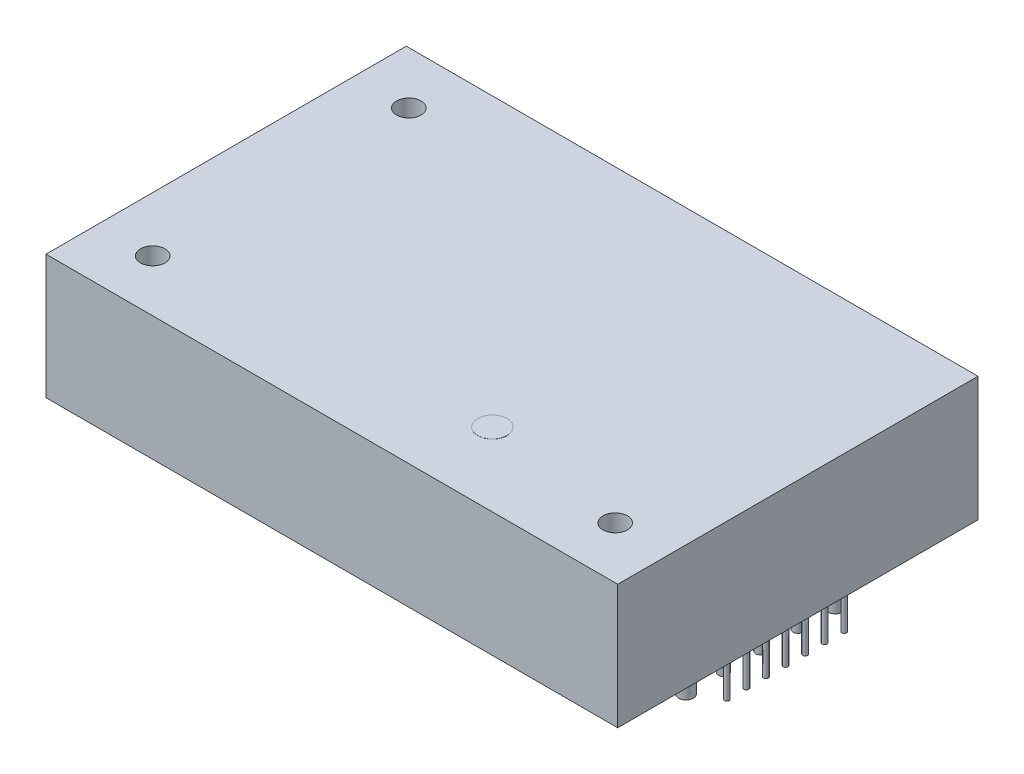
ISO-10303-21;
HEADER;
FILE_DESCRIPTION(('STEP AP214'),'2;1');
FILE_NAME('part.step','',(''),(''),'','','');
FILE_SCHEMA(('AUTOMOTIVE_DESIGN { 1 0 10303 214 1 1 1 1 }'));
ENDSEC;
DATA;
#1=APPLICATION_CONTEXT('core data for automotive mechanical design processes');
#2=APPLICATION_PROTOCOL_DEFINITION('international standard','automotive_design',2000,#1);
#3=PRODUCT_CONTEXT('',#1,'mechanical');
#4=PRODUCT('Part','Part','',(#3));
#5=PRODUCT_RELATED_PRODUCT_CATEGORY('part','',(#4));
#6=PRODUCT_DEFINITION_FORMATION('','',#4);
#7=PRODUCT_DEFINITION_CONTEXT('part definition',#1,'design');
#8=PRODUCT_DEFINITION('design','',#6,#7);
#9=PRODUCT_DEFINITION_SHAPE('','',#8);
#10=(LENGTH_UNIT() NAMED_UNIT(*) SI_UNIT(.MILLI.,.METRE.));
#11=(NAMED_UNIT(*) PLANE_ANGLE_UNIT() SI_UNIT($,.RADIAN.));
#12=(NAMED_UNIT(*) SI_UNIT($,.STERADIAN.) SOLID_ANGLE_UNIT());
#13=UNCERTAINTY_MEASURE_WITH_UNIT(LENGTH_MEASURE(1.E-05),#10,'distance_accuracy_value','');
#14=(GEOMETRIC_REPRESENTATION_CONTEXT(3) GLOBAL_UNCERTAINTY_ASSIGNED_CONTEXT((#13)) GLOBAL_UNIT_ASSIGNED_CONTEXT((#10,
#11,#12)) REPRESENTATION_CONTEXT('',''));
#15=CARTESIAN_POINT('',(0.,0.,0.));
#16=DIRECTION('',(0.,0.,1.));
#17=DIRECTION('',(1.,0.,0.));
#18=AXIS2_PLACEMENT_3D('',#15,#16,#17);
#19=CARTESIAN_POINT('',(-29.2,12.7,-18.4));
#20=DIRECTION('',(1.,0.,0.));
#21=DIRECTION('',(0.,0.,-1.));
#22=AXIS2_PLACEMENT_3D('',#19,#20,#21);
#23=PLANE('',#22);
#24=DIRECTION('',(0.,0.,1.));
#25=VECTOR('',#24,1.);
#26=CARTESIAN_POINT('',(-29.2,0.,-18.4));
#27=LINE('',#26,#25);
#28=CARTESIAN_POINT('',(-29.2,0.,-18.4));
#29=VERTEX_POINT('',#28);
#30=CARTESIAN_POINT('',(-29.2,0.,18.4));
#31=VERTEX_POINT('',#30);
#32=EDGE_CURVE('E219',#29,#31,#27,.T.);
#33=ORIENTED_EDGE('',*,*,#32,.T.);
#34=DIRECTION('',(0.,-1.,0.));
#35=VECTOR('',#34,1.);
#36=CARTESIAN_POINT('',(-29.2,12.7,18.4));
#37=LINE('',#36,#35);
#38=CARTESIAN_POINT('',(-29.2,12.7,18.4));
#39=VERTEX_POINT('',#38);
#40=EDGE_CURVE('E46',#39,#31,#37,.T.);
#41=ORIENTED_EDGE('',*,*,#40,.F.);
#42=DIRECTION('',(0.,0.,1.));
#43=VECTOR('',#42,1.);
#44=CARTESIAN_POINT('',(-29.2,12.7,-18.4));
#45=LINE('',#44,#43);
#46=CARTESIAN_POINT('',(-29.2,12.7,-18.4));
#47=VERTEX_POINT('',#46);
#48=EDGE_CURVE('E222',#47,#39,#45,.T.);
#49=ORIENTED_EDGE('',*,*,#48,.F.);
#50=DIRECTION('',(0.,-1.,0.));
#51=VECTOR('',#50,1.);
#52=CARTESIAN_POINT('',(-29.2,12.7,-18.4));
#53=LINE('',#52,#51);
#54=EDGE_CURVE('E228',#47,#29,#53,.T.);
#55=ORIENTED_EDGE('',*,*,#54,.T.);
#56=EDGE_LOOP('',(#33,#41,#49,#55));
#57=FACE_BOUND('',#56,.T.);
#58=ADVANCED_FACE('F38',(#57),#23,.F.);
#59=CARTESIAN_POINT('',(29.2,12.7,18.4));
#60=DIRECTION('',(0.,0.,-1.));
#61=DIRECTION('',(-1.,0.,0.));
#62=AXIS2_PLACEMENT_3D('',#59,#60,#61);
#63=PLANE('',#62);
#64=DIRECTION('',(1.,0.,0.));
#65=VECTOR('',#64,1.);
#66=CARTESIAN_POINT('',(29.2,0.,18.4));
#67=LINE('',#66,#65);
#68=CARTESIAN_POINT('',(29.2,0.,18.4));
#69=VERTEX_POINT('',#68);
#70=EDGE_CURVE('E231',#31,#69,#67,.T.);
#71=ORIENTED_EDGE('',*,*,#70,.T.);
#72=DIRECTION('',(0.,-1.,0.));
#73=VECTOR('',#72,1.);
#74=CARTESIAN_POINT('',(29.2,12.7,18.4));
#75=LINE('',#74,#73);
#76=CARTESIAN_POINT('',(29.2,12.7,18.4));
#77=VERTEX_POINT('',#76);
#78=EDGE_CURVE('E238',#77,#69,#75,.T.);
#79=ORIENTED_EDGE('',*,*,#78,.F.);
#80=DIRECTION('',(1.,0.,0.));
#81=VECTOR('',#80,1.);
#82=CARTESIAN_POINT('',(29.2,12.7,18.4));
#83=LINE('',#82,#81);
#84=EDGE_CURVE('E86',#39,#77,#83,.T.);
#85=ORIENTED_EDGE('',*,*,#84,.F.);
#86=ORIENTED_EDGE('',*,*,#40,.T.);
#87=EDGE_LOOP('',(#71,#79,#85,#86));
#88=FACE_BOUND('',#87,.T.);
#89=ADVANCED_FACE('F240',(#88),#63,.F.);
#90=CARTESIAN_POINT('',(29.2,12.7,-18.4));
#91=DIRECTION('',(-1.,0.,0.));
#92=DIRECTION('',(0.,0.,1.));
#93=AXIS2_PLACEMENT_3D('',#90,#91,#92);
#94=PLANE('',#93);
#95=DIRECTION('',(0.,0.,-1.));
#96=VECTOR('',#95,1.);
#97=CARTESIAN_POINT('',(29.2,0.,-18.4));
#98=LINE('',#97,#96);
#99=CARTESIAN_POINT('',(29.2,0.,-18.4));
#100=VERTEX_POINT('',#99);
#101=EDGE_CURVE('E72',#69,#100,#98,.T.);
#102=ORIENTED_EDGE('',*,*,#101,.T.);
#103=DIRECTION('',(0.,-1.,0.));
#104=VECTOR('',#103,1.);
#105=CARTESIAN_POINT('',(29.2,12.7,-18.4));
#106=LINE('',#105,#104);
#107=CARTESIAN_POINT('',(29.2,12.7,-18.4));
#108=VERTEX_POINT('',#107);
#109=EDGE_CURVE('E236',#108,#100,#106,.T.);
#110=ORIENTED_EDGE('',*,*,#109,.F.);
#111=DIRECTION('',(0.,0.,-1.));
#112=VECTOR('',#111,1.);
#113=CARTESIAN_POINT('',(29.2,12.7,-18.4));
#114=LINE('',#113,#112);
#115=EDGE_CURVE('E225',#77,#108,#114,.T.);
#116=ORIENTED_EDGE('',*,*,#115,.F.);
#117=ORIENTED_EDGE('',*,*,#78,.T.);
#118=EDGE_LOOP('',(#102,#110,#116,#117));
#119=FACE_BOUND('',#118,.T.);
#120=ADVANCED_FACE('F268',(#119),#94,.F.);
#121=CARTESIAN_POINT('',(29.2,12.7,-18.4));
#122=DIRECTION('',(0.,0.,1.));
#123=DIRECTION('',(1.,0.,0.));
#124=AXIS2_PLACEMENT_3D('',#121,#122,#123);
#125=PLANE('',#124);
#126=DIRECTION('',(-1.,0.,0.));
#127=VECTOR('',#126,1.);
#128=CARTESIAN_POINT('',(29.2,0.,-18.4));
#129=LINE('',#128,#127);
#130=EDGE_CURVE('E78',#100,#29,#129,.T.);
#131=ORIENTED_EDGE('',*,*,#130,.T.);
#132=ORIENTED_EDGE('',*,*,#54,.F.);
#133=DIRECTION('',(-1.,0.,0.));
#134=VECTOR('',#133,1.);
#135=CARTESIAN_POINT('',(29.2,12.7,-18.4));
#136=LINE('',#135,#134);
#137=EDGE_CURVE('E54',#108,#47,#136,.T.);
#138=ORIENTED_EDGE('',*,*,#137,.F.);
#139=ORIENTED_EDGE('',*,*,#109,.T.);
#140=EDGE_LOOP('',(#131,#132,#138,#139));
#141=FACE_BOUND('',#140,.T.);
#142=ADVANCED_FACE('F258',(#141),#125,.F.);
#143=CARTESIAN_POINT('',(0.,12.7,0.));
#144=DIRECTION('',(0.,-1.,0.));
#145=DIRECTION('',(0.,0.,-1.));
#146=AXIS2_PLACEMENT_3D('',#143,#144,#145);
#147=PLANE('',#146);
#148=CARTESIAN_POINT('',(8.9,12.7,10.9));
#149=DIRECTION('',(0.,-1.,0.));
#150=DIRECTION('',(0.,0.,-1.));
#151=AXIS2_PLACEMENT_3D('',#148,#149,#150);
#152=CIRCLE('',#151,1.5);
#153=CARTESIAN_POINT('',(8.9,12.7,9.4));
#154=VERTEX_POINT('',#153);
#155=EDGE_CURVE('E11',#154,#154,#152,.F.);
#156=ORIENTED_EDGE('',*,*,#155,.F.);
#157=EDGE_LOOP('',(#156));
#158=FACE_BOUND('',#157,.T.);
#159=CARTESIAN_POINT('',(-23.6,12.7,-13.06));
#160=DIRECTION('',(0.,1.,0.));
#161=DIRECTION('',(0.,0.,1.));
#162=AXIS2_PLACEMENT_3D('',#159,#160,#161);
#163=CIRCLE('',#162,1.24999999999999);
#164=CARTESIAN_POINT('',(-23.6,12.7,-11.81));
#165=VERTEX_POINT('',#164);
#166=EDGE_CURVE('E107',#165,#165,#163,.T.);
#167=ORIENTED_EDGE('',*,*,#166,.F.);
#168=EDGE_LOOP('',(#167));
#169=FACE_BOUND('',#168,.T.);
#170=CARTESIAN_POINT('',(-23.6,12.7,13.1));
#171=DIRECTION('',(0.,1.,0.));
#172=DIRECTION('',(0.,0.,1.));
#173=AXIS2_PLACEMENT_3D('',#170,#171,#172);
#174=CIRCLE('',#173,1.24999999999999);
#175=CARTESIAN_POINT('',(-23.6,12.7,14.35));
#176=VERTEX_POINT('',#175);
#177=EDGE_CURVE('E106',#176,#176,#174,.T.);
#178=ORIENTED_EDGE('',*,*,#177,.F.);
#179=EDGE_LOOP('',(#178));
#180=FACE_BOUND('',#179,.T.);
#181=CARTESIAN_POINT('',(23.64,12.7,13.1));
#182=DIRECTION('',(0.,1.,0.));
#183=DIRECTION('',(0.,0.,1.));
#184=AXIS2_PLACEMENT_3D('',#181,#182,#183);
#185=CIRCLE('',#184,1.24999999999999);
#186=CARTESIAN_POINT('',(23.64,12.7,14.35));
#187=VERTEX_POINT('',#186);
#188=EDGE_CURVE('E119',#187,#187,#185,.T.);
#189=ORIENTED_EDGE('',*,*,#188,.F.);
#190=EDGE_LOOP('',(#189));
#191=FACE_BOUND('',#190,.T.);
#192=ORIENTED_EDGE('',*,*,#48,.T.);
#193=ORIENTED_EDGE('',*,*,#84,.T.);
#194=ORIENTED_EDGE('',*,*,#115,.T.);
#195=ORIENTED_EDGE('',*,*,#137,.T.);
#196=EDGE_LOOP('',(#192,#193,#194,#195));
#197=FACE_BOUND('',#196,.T.);
#198=ADVANCED_FACE('F248',(#158,#169,#180,#191,#197),#147,.F.);
#199=CARTESIAN_POINT('',(0.,0.,0.));
#200=DIRECTION('',(0.,-1.,0.));
#201=DIRECTION('',(0.,0.,-1.));
#202=AXIS2_PLACEMENT_3D('',#199,#200,#201);
#203=PLANE('',#202);
#204=CARTESIAN_POINT('',(-25.4,0.,-7.62));
#205=DIRECTION('',(0.,-1.,0.));
#206=DIRECTION('',(0.,0.,-1.));
#207=AXIS2_PLACEMENT_3D('',#204,#205,#206);
#208=CIRCLE('',#207,0.499999999999999);
#209=CARTESIAN_POINT('',(-25.4,0.,-8.12));
#210=VERTEX_POINT('',#209);
#211=EDGE_CURVE('E125',#210,#210,#208,.T.);
#212=ORIENTED_EDGE('',*,*,#211,.F.);
#213=EDGE_LOOP('',(#212));
#214=FACE_BOUND('',#213,.T.);
#215=CARTESIAN_POINT('',(-25.4,0.,0.));
#216=DIRECTION('',(0.,-1.,0.));
#217=DIRECTION('',(0.,0.,-1.));
#218=AXIS2_PLACEMENT_3D('',#215,#216,#217);
#219=CIRCLE('',#218,0.499999999999999);
#220=CARTESIAN_POINT('',(-25.4,0.,-0.499999999999999));
#221=VERTEX_POINT('',#220);
#222=EDGE_CURVE('E129',#221,#221,#219,.T.);
#223=ORIENTED_EDGE('',*,*,#222,.F.);
#224=EDGE_LOOP('',(#223));
#225=FACE_BOUND('',#224,.T.);
#226=CARTESIAN_POINT('',(-25.4,0.,3.81));
#227=DIRECTION('',(0.,-1.,0.));
#228=DIRECTION('',(0.,0.,-1.));
#229=AXIS2_PLACEMENT_3D('',#226,#227,#228);
#230=CIRCLE('',#229,0.499999999999999);
#231=CARTESIAN_POINT('',(-25.4,0.,3.31));
#232=VERTEX_POINT('',#231);
#233=EDGE_CURVE('E135',#232,#232,#230,.T.);
#234=ORIENTED_EDGE('',*,*,#233,.F.);
#235=EDGE_LOOP('',(#234));
#236=FACE_BOUND('',#235,.T.);
#237=CARTESIAN_POINT('',(-25.4,0.,7.62));
#238=DIRECTION('',(0.,-1.,0.));
#239=DIRECTION('',(0.,0.,-1.));
#240=AXIS2_PLACEMENT_3D('',#237,#238,#239);
#241=CIRCLE('',#240,0.499999999999999);
#242=CARTESIAN_POINT('',(-25.4,0.,7.12));
#243=VERTEX_POINT('',#242);
#244=EDGE_CURVE('E141',#243,#243,#241,.T.);
#245=ORIENTED_EDGE('',*,*,#244,.F.);
#246=EDGE_LOOP('',(#245));
#247=FACE_BOUND('',#246,.T.);
#248=CARTESIAN_POINT('',(25.4,0.,3.81));
#249=DIRECTION('',(0.,-1.,0.));
#250=DIRECTION('',(0.,0.,-1.));
#251=AXIS2_PLACEMENT_3D('',#248,#249,#250);
#252=CIRCLE('',#251,0.499999999999999);
#253=CARTESIAN_POINT('',(25.4,0.,3.31));
#254=VERTEX_POINT('',#253);
#255=EDGE_CURVE('E147',#254,#254,#252,.T.);
#256=ORIENTED_EDGE('',*,*,#255,.F.);
#257=EDGE_LOOP('',(#256));
#258=FACE_BOUND('',#257,.T.);
#259=CARTESIAN_POINT('',(25.4,0.,0.));
#260=DIRECTION('',(0.,-1.,0.));
#261=DIRECTION('',(0.,0.,-1.));
#262=AXIS2_PLACEMENT_3D('',#259,#260,#261);
#263=CIRCLE('',#262,0.499999999999999);
#264=CARTESIAN_POINT('',(25.4,0.,-0.499999999999999));
#265=VERTEX_POINT('',#264);
#266=EDGE_CURVE('E153',#265,#265,#263,.T.);
#267=ORIENTED_EDGE('',*,*,#266,.F.);
#268=EDGE_LOOP('',(#267));
#269=FACE_BOUND('',#268,.T.);
#270=CARTESIAN_POINT('',(25.4,0.,-3.81));
#271=DIRECTION('',(0.,-1.,0.));
#272=DIRECTION('',(0.,0.,-1.));
#273=AXIS2_PLACEMENT_3D('',#270,#271,#272);
#274=CIRCLE('',#273,0.499999999999999);
#275=CARTESIAN_POINT('',(25.4,0.,-4.31));
#276=VERTEX_POINT('',#275);
#277=EDGE_CURVE('E159',#276,#276,#274,.T.);
#278=ORIENTED_EDGE('',*,*,#277,.F.);
#279=EDGE_LOOP('',(#278));
#280=FACE_BOUND('',#279,.T.);
#281=CARTESIAN_POINT('',(25.4,0.,-7.62));
#282=DIRECTION('',(0.,-1.,0.));
#283=DIRECTION('',(0.,0.,-1.));
#284=AXIS2_PLACEMENT_3D('',#281,#282,#283);
#285=CIRCLE('',#284,0.750000000000002);
#286=CARTESIAN_POINT('',(25.4,0.,-8.37));
#287=VERTEX_POINT('',#286);
#288=EDGE_CURVE('E165',#287,#287,#285,.T.);
#289=ORIENTED_EDGE('',*,*,#288,.F.);
#290=EDGE_LOOP('',(#289));
#291=FACE_BOUND('',#290,.T.);
#292=CARTESIAN_POINT('',(27.94,0.,-6.));
#293=DIRECTION('',(0.,-1.,0.));
#294=DIRECTION('',(0.,0.,-1.));
#295=AXIS2_PLACEMENT_3D('',#292,#293,#294);
#296=CIRCLE('',#295,0.25);
#297=CARTESIAN_POINT('',(27.94,0.,-6.25));
#298=VERTEX_POINT('',#297);
#299=EDGE_CURVE('E171',#298,#298,#296,.T.);
#300=ORIENTED_EDGE('',*,*,#299,.F.);
#301=EDGE_LOOP('',(#300));
#302=FACE_BOUND('',#301,.T.);
#303=CARTESIAN_POINT('',(27.94,0.,-4.));
#304=DIRECTION('',(0.,-1.,0.));
#305=DIRECTION('',(0.,0.,-1.));
#306=AXIS2_PLACEMENT_3D('',#303,#304,#305);
#307=CIRCLE('',#306,0.25);
#308=CARTESIAN_POINT('',(27.94,0.,-4.25));
#309=VERTEX_POINT('',#308);
#310=EDGE_CURVE('E177',#309,#309,#307,.T.);
#311=ORIENTED_EDGE('',*,*,#310,.F.);
#312=EDGE_LOOP('',(#311));
#313=FACE_BOUND('',#312,.T.);
#314=CARTESIAN_POINT('',(27.94,0.,-2.));
#315=DIRECTION('',(0.,-1.,0.));
#316=DIRECTION('',(0.,0.,-1.));
#317=AXIS2_PLACEMENT_3D('',#314,#315,#316);
#318=CIRCLE('',#317,0.25);
#319=CARTESIAN_POINT('',(27.94,0.,-2.25));
#320=VERTEX_POINT('',#319);
#321=EDGE_CURVE('E183',#320,#320,#318,.T.);
#322=ORIENTED_EDGE('',*,*,#321,.F.);
#323=EDGE_LOOP('',(#322));
#324=FACE_BOUND('',#323,.T.);
#325=CARTESIAN_POINT('',(27.94,0.,0.));
#326=DIRECTION('',(0.,-1.,0.));
#327=DIRECTION('',(0.,0.,-1.));
#328=AXIS2_PLACEMENT_3D('',#325,#326,#327);
#329=CIRCLE('',#328,0.25);
#330=CARTESIAN_POINT('',(27.94,0.,-0.25));
#331=VERTEX_POINT('',#330);
#332=EDGE_CURVE('E189',#331,#331,#329,.T.);
#333=ORIENTED_EDGE('',*,*,#332,.F.);
#334=EDGE_LOOP('',(#333));
#335=FACE_BOUND('',#334,.T.);
#336=CARTESIAN_POINT('',(27.94,0.,2.));
#337=DIRECTION('',(0.,-1.,0.));
#338=DIRECTION('',(0.,0.,-1.));
#339=AXIS2_PLACEMENT_3D('',#336,#337,#338);
#340=CIRCLE('',#339,0.25);
#341=CARTESIAN_POINT('',(27.94,0.,1.75));
#342=VERTEX_POINT('',#341);
#343=EDGE_CURVE('E195',#342,#342,#340,.T.);
#344=ORIENTED_EDGE('',*,*,#343,.F.);
#345=EDGE_LOOP('',(#344));
#346=FACE_BOUND('',#345,.T.);
#347=CARTESIAN_POINT('',(27.94,0.,4.));
#348=DIRECTION('',(0.,-1.,0.));
#349=DIRECTION('',(0.,0.,-1.));
#350=AXIS2_PLACEMENT_3D('',#347,#348,#349);
#351=CIRCLE('',#350,0.25);
#352=CARTESIAN_POINT('',(27.94,0.,3.75));
#353=VERTEX_POINT('',#352);
#354=EDGE_CURVE('E201',#353,#353,#351,.T.);
#355=ORIENTED_EDGE('',*,*,#354,.F.);
#356=EDGE_LOOP('',(#355));
#357=FACE_BOUND('',#356,.T.);
#358=CARTESIAN_POINT('',(27.94,0.,6.));
#359=DIRECTION('',(0.,-1.,0.));
#360=DIRECTION('',(0.,0.,-1.));
#361=AXIS2_PLACEMENT_3D('',#358,#359,#360);
#362=CIRCLE('',#361,0.25);
#363=CARTESIAN_POINT('',(27.94,0.,5.75));
#364=VERTEX_POINT('',#363);
#365=EDGE_CURVE('E207',#364,#364,#362,.T.);
#366=ORIENTED_EDGE('',*,*,#365,.F.);
#367=EDGE_LOOP('',(#366));
#368=FACE_BOUND('',#367,.T.);
#369=CARTESIAN_POINT('',(25.4,0.,7.62));
#370=DIRECTION('',(0.,-1.,0.));
#371=DIRECTION('',(0.,0.,-1.));
#372=AXIS2_PLACEMENT_3D('',#369,#370,#371);
#373=CIRCLE('',#372,0.750000000000002);
#374=CARTESIAN_POINT('',(25.4,0.,6.87));
#375=VERTEX_POINT('',#374);
#376=EDGE_CURVE('E213',#375,#375,#373,.T.);
#377=ORIENTED_EDGE('',*,*,#376,.F.);
#378=EDGE_LOOP('',(#377));
#379=FACE_BOUND('',#378,.T.);
#380=ORIENTED_EDGE('',*,*,#32,.F.);
#381=ORIENTED_EDGE('',*,*,#130,.F.);
#382=ORIENTED_EDGE('',*,*,#101,.F.);
#383=ORIENTED_EDGE('',*,*,#70,.F.);
#384=EDGE_LOOP('',(#380,#381,#382,#383));
#385=FACE_BOUND('',#384,.T.);
#386=ADVANCED_FACE('F245',(#214,#225,#236,#247,#258,#269,#280,#291,#302,#313,#324,#335,#346,
#357,#368,#379,#385),#203,.T.);
#387=CARTESIAN_POINT('',(25.4,-4.3,7.62));
#388=DIRECTION('',(0.,1.,0.));
#389=DIRECTION('',(0.,0.,1.));
#390=AXIS2_PLACEMENT_3D('',#387,#388,#389);
#391=CYLINDRICAL_SURFACE('',#390,0.750000000000002);
#392=CARTESIAN_POINT('',(25.4,-4.3,7.62));
#393=DIRECTION('',(0.,-1.,0.));
#394=DIRECTION('',(0.,0.,-1.));
#395=AXIS2_PLACEMENT_3D('',#392,#393,#394);
#396=CIRCLE('',#395,0.750000000000002);
#397=CARTESIAN_POINT('',(25.4,-4.3,6.87));
#398=VERTEX_POINT('',#397);
#399=EDGE_CURVE('E216',#398,#398,#396,.T.);
#400=ORIENTED_EDGE('',*,*,#399,.F.);
#401=EDGE_LOOP('',(#400));
#402=FACE_BOUND('',#401,.T.);
#403=ORIENTED_EDGE('',*,*,#376,.T.);
#404=EDGE_LOOP('',(#403));
#405=FACE_BOUND('',#404,.T.);
#406=ADVANCED_FACE('F247',(#402,#405),#391,.T.);
#407=CARTESIAN_POINT('',(0.,-4.3,0.));
#408=DIRECTION('',(0.,-1.,0.));
#409=DIRECTION('',(0.,0.,-1.));
#410=AXIS2_PLACEMENT_3D('',#407,#408,#409);
#411=PLANE('',#410);
#412=ORIENTED_EDGE('',*,*,#399,.T.);
#413=EDGE_LOOP('',(#412));
#414=FACE_BOUND('',#413,.T.);
#415=ADVANCED_FACE('F255',(#414),#411,.T.);
#416=CARTESIAN_POINT('',(27.94,-4.3,6.));
#417=DIRECTION('',(0.,1.,0.));
#418=DIRECTION('',(0.,0.,1.));
#419=AXIS2_PLACEMENT_3D('',#416,#417,#418);
#420=CYLINDRICAL_SURFACE('',#419,0.25);
#421=CARTESIAN_POINT('',(27.94,-4.3,6.));
#422=DIRECTION('',(0.,-1.,0.));
#423=DIRECTION('',(0.,0.,-1.));
#424=AXIS2_PLACEMENT_3D('',#421,#422,#423);
#425=CIRCLE('',#424,0.25);
#426=CARTESIAN_POINT('',(27.94,-4.3,5.75));
#427=VERTEX_POINT('',#426);
#428=EDGE_CURVE('E210',#427,#427,#425,.T.);
#429=ORIENTED_EDGE('',*,*,#428,.F.);
#430=EDGE_LOOP('',(#429));
#431=FACE_BOUND('',#430,.T.);
#432=ORIENTED_EDGE('',*,*,#365,.T.);
#433=EDGE_LOOP('',(#432));
#434=FACE_BOUND('',#433,.T.);
#435=ADVANCED_FACE('F643',(#431,#434),#420,.T.);
#436=CARTESIAN_POINT('',(0.,-4.3,0.));
#437=DIRECTION('',(0.,-1.,0.));
#438=DIRECTION('',(0.,0.,-1.));
#439=AXIS2_PLACEMENT_3D('',#436,#437,#438);
#440=PLANE('',#439);
#441=ORIENTED_EDGE('',*,*,#428,.T.);
#442=EDGE_LOOP('',(#441));
#443=FACE_BOUND('',#442,.T.);
#444=ADVANCED_FACE('F632',(#443),#440,.T.);
#445=CARTESIAN_POINT('',(27.94,-4.3,4.));
#446=DIRECTION('',(0.,1.,0.));
#447=DIRECTION('',(0.,0.,1.));
#448=AXIS2_PLACEMENT_3D('',#445,#446,#447);
#449=CYLINDRICAL_SURFACE('',#448,0.25);
#450=CARTESIAN_POINT('',(27.94,-4.3,4.));
#451=DIRECTION('',(0.,-1.,0.));
#452=DIRECTION('',(0.,0.,-1.));
#453=AXIS2_PLACEMENT_3D('',#450,#451,#452);
#454=CIRCLE('',#453,0.25);
#455=CARTESIAN_POINT('',(27.94,-4.3,3.75));
#456=VERTEX_POINT('',#455);
#457=EDGE_CURVE('E204',#456,#456,#454,.T.);
#458=ORIENTED_EDGE('',*,*,#457,.F.);
#459=EDGE_LOOP('',(#458));
#460=FACE_BOUND('',#459,.T.);
#461=ORIENTED_EDGE('',*,*,#354,.T.);
#462=EDGE_LOOP('',(#461));
#463=FACE_BOUND('',#462,.T.);
#464=ADVANCED_FACE('F621',(#460,#463),#449,.T.);
#465=CARTESIAN_POINT('',(0.,-4.3,0.));
#466=DIRECTION('',(0.,-1.,0.));
#467=DIRECTION('',(0.,0.,-1.));
#468=AXIS2_PLACEMENT_3D('',#465,#466,#467);
#469=PLANE('',#468);
#470=ORIENTED_EDGE('',*,*,#457,.T.);
#471=EDGE_LOOP('',(#470));
#472=FACE_BOUND('',#471,.T.);
#473=ADVANCED_FACE('F610',(#472),#469,.T.);
#474=CARTESIAN_POINT('',(27.94,-4.3,2.));
#475=DIRECTION('',(0.,1.,0.));
#476=DIRECTION('',(0.,0.,1.));
#477=AXIS2_PLACEMENT_3D('',#474,#475,#476);
#478=CYLINDRICAL_SURFACE('',#477,0.25);
#479=CARTESIAN_POINT('',(27.94,-4.3,2.));
#480=DIRECTION('',(0.,-1.,0.));
#481=DIRECTION('',(0.,0.,-1.));
#482=AXIS2_PLACEMENT_3D('',#479,#480,#481);
#483=CIRCLE('',#482,0.25);
#484=CARTESIAN_POINT('',(27.94,-4.3,1.75));
#485=VERTEX_POINT('',#484);
#486=EDGE_CURVE('E198',#485,#485,#483,.T.);
#487=ORIENTED_EDGE('',*,*,#486,.F.);
#488=EDGE_LOOP('',(#487));
#489=FACE_BOUND('',#488,.T.);
#490=ORIENTED_EDGE('',*,*,#343,.T.);
#491=EDGE_LOOP('',(#490));
#492=FACE_BOUND('',#491,.T.);
#493=ADVANCED_FACE('F599',(#489,#492),#478,.T.);
#494=CARTESIAN_POINT('',(0.,-4.3,0.));
#495=DIRECTION('',(0.,-1.,0.));
#496=DIRECTION('',(0.,0.,-1.));
#497=AXIS2_PLACEMENT_3D('',#494,#495,#496);
#498=PLANE('',#497);
#499=ORIENTED_EDGE('',*,*,#486,.T.);
#500=EDGE_LOOP('',(#499));
#501=FACE_BOUND('',#500,.T.);
#502=ADVANCED_FACE('F588',(#501),#498,.T.);
#503=CARTESIAN_POINT('',(27.94,-4.3,0.));
#504=DIRECTION('',(0.,1.,0.));
#505=DIRECTION('',(0.,0.,1.));
#506=AXIS2_PLACEMENT_3D('',#503,#504,#505);
#507=CYLINDRICAL_SURFACE('',#506,0.25);
#508=CARTESIAN_POINT('',(27.94,-4.3,0.));
#509=DIRECTION('',(0.,-1.,0.));
#510=DIRECTION('',(0.,0.,-1.));
#511=AXIS2_PLACEMENT_3D('',#508,#509,#510);
#512=CIRCLE('',#511,0.25);
#513=CARTESIAN_POINT('',(27.94,-4.3,-0.25));
#514=VERTEX_POINT('',#513);
#515=EDGE_CURVE('E192',#514,#514,#512,.T.);
#516=ORIENTED_EDGE('',*,*,#515,.F.);
#517=EDGE_LOOP('',(#516));
#518=FACE_BOUND('',#517,.T.);
#519=ORIENTED_EDGE('',*,*,#332,.T.);
#520=EDGE_LOOP('',(#519));
#521=FACE_BOUND('',#520,.T.);
#522=ADVANCED_FACE('F577',(#518,#521),#507,.T.);
#523=CARTESIAN_POINT('',(0.,-4.3,0.));
#524=DIRECTION('',(0.,-1.,0.));
#525=DIRECTION('',(0.,0.,-1.));
#526=AXIS2_PLACEMENT_3D('',#523,#524,#525);
#527=PLANE('',#526);
#528=ORIENTED_EDGE('',*,*,#515,.T.);
#529=EDGE_LOOP('',(#528));
#530=FACE_BOUND('',#529,.T.);
#531=ADVANCED_FACE('F566',(#530),#527,.T.);
#532=CARTESIAN_POINT('',(27.94,-4.3,-2.));
#533=DIRECTION('',(0.,1.,0.));
#534=DIRECTION('',(0.,0.,1.));
#535=AXIS2_PLACEMENT_3D('',#532,#533,#534);
#536=CYLINDRICAL_SURFACE('',#535,0.25);
#537=CARTESIAN_POINT('',(27.94,-4.3,-2.));
#538=DIRECTION('',(0.,-1.,0.));
#539=DIRECTION('',(0.,0.,-1.));
#540=AXIS2_PLACEMENT_3D('',#537,#538,#539);
#541=CIRCLE('',#540,0.25);
#542=CARTESIAN_POINT('',(27.94,-4.3,-2.25));
#543=VERTEX_POINT('',#542);
#544=EDGE_CURVE('E186',#543,#543,#541,.T.);
#545=ORIENTED_EDGE('',*,*,#544,.F.);
#546=EDGE_LOOP('',(#545));
#547=FACE_BOUND('',#546,.T.);
#548=ORIENTED_EDGE('',*,*,#321,.T.);
#549=EDGE_LOOP('',(#548));
#550=FACE_BOUND('',#549,.T.);
#551=ADVANCED_FACE('F556',(#547,#550),#536,.T.);
#552=CARTESIAN_POINT('',(0.,-4.3,0.));
#553=DIRECTION('',(0.,-1.,0.));
#554=DIRECTION('',(0.,0.,-1.));
#555=AXIS2_PLACEMENT_3D('',#552,#553,#554);
#556=PLANE('',#555);
#557=ORIENTED_EDGE('',*,*,#544,.T.);
#558=EDGE_LOOP('',(#557));
#559=FACE_BOUND('',#558,.T.);
#560=ADVANCED_FACE('F544',(#559),#556,.T.);
#561=CARTESIAN_POINT('',(27.94,-4.3,-4.));
#562=DIRECTION('',(0.,1.,0.));
#563=DIRECTION('',(0.,0.,1.));
#564=AXIS2_PLACEMENT_3D('',#561,#562,#563);
#565=CYLINDRICAL_SURFACE('',#564,0.25);
#566=CARTESIAN_POINT('',(27.94,-4.3,-4.));
#567=DIRECTION('',(0.,-1.,0.));
#568=DIRECTION('',(0.,0.,-1.));
#569=AXIS2_PLACEMENT_3D('',#566,#567,#568);
#570=CIRCLE('',#569,0.25);
#571=CARTESIAN_POINT('',(27.94,-4.3,-4.25));
#572=VERTEX_POINT('',#571);
#573=EDGE_CURVE('E180',#572,#572,#570,.T.);
#574=ORIENTED_EDGE('',*,*,#573,.F.);
#575=EDGE_LOOP('',(#574));
#576=FACE_BOUND('',#575,.T.);
#577=ORIENTED_EDGE('',*,*,#310,.T.);
#578=EDGE_LOOP('',(#577));
#579=FACE_BOUND('',#578,.T.);
#580=ADVANCED_FACE('F535',(#576,#579),#565,.T.);
#581=CARTESIAN_POINT('',(0.,-4.3,0.));
#582=DIRECTION('',(0.,-1.,0.));
#583=DIRECTION('',(0.,0.,-1.));
#584=AXIS2_PLACEMENT_3D('',#581,#582,#583);
#585=PLANE('',#584);
#586=ORIENTED_EDGE('',*,*,#573,.T.);
#587=EDGE_LOOP('',(#586));
#588=FACE_BOUND('',#587,.T.);
#589=ADVANCED_FACE('F526',(#588),#585,.T.);
#590=CARTESIAN_POINT('',(27.94,-4.3,-6.));
#591=DIRECTION('',(0.,1.,0.));
#592=DIRECTION('',(0.,0.,1.));
#593=AXIS2_PLACEMENT_3D('',#590,#591,#592);
#594=CYLINDRICAL_SURFACE('',#593,0.25);
#595=CARTESIAN_POINT('',(27.94,-4.3,-6.));
#596=DIRECTION('',(0.,-1.,0.));
#597=DIRECTION('',(0.,0.,-1.));
#598=AXIS2_PLACEMENT_3D('',#595,#596,#597);
#599=CIRCLE('',#598,0.25);
#600=CARTESIAN_POINT('',(27.94,-4.3,-6.25));
#601=VERTEX_POINT('',#600);
#602=EDGE_CURVE('E174',#601,#601,#599,.T.);
#603=ORIENTED_EDGE('',*,*,#602,.F.);
#604=EDGE_LOOP('',(#603));
#605=FACE_BOUND('',#604,.T.);
#606=ORIENTED_EDGE('',*,*,#299,.T.);
#607=EDGE_LOOP('',(#606));
#608=FACE_BOUND('',#607,.T.);
#609=ADVANCED_FACE('F517',(#605,#608),#594,.T.);
#610=CARTESIAN_POINT('',(0.,-4.3,0.));
#611=DIRECTION('',(0.,-1.,0.));
#612=DIRECTION('',(0.,0.,-1.));
#613=AXIS2_PLACEMENT_3D('',#610,#611,#612);
#614=PLANE('',#613);
#615=ORIENTED_EDGE('',*,*,#602,.T.);
#616=EDGE_LOOP('',(#615));
#617=FACE_BOUND('',#616,.T.);
#618=ADVANCED_FACE('F508',(#617),#614,.T.);
#619=CARTESIAN_POINT('',(25.4,-4.3,-7.62));
#620=DIRECTION('',(0.,1.,0.));
#621=DIRECTION('',(0.,0.,1.));
#622=AXIS2_PLACEMENT_3D('',#619,#620,#621);
#623=CYLINDRICAL_SURFACE('',#622,0.750000000000002);
#624=CARTESIAN_POINT('',(25.4,-4.3,-7.62));
#625=DIRECTION('',(0.,-1.,0.));
#626=DIRECTION('',(0.,0.,-1.));
#627=AXIS2_PLACEMENT_3D('',#624,#625,#626);
#628=CIRCLE('',#627,0.750000000000002);
#629=CARTESIAN_POINT('',(25.4,-4.3,-8.37));
#630=VERTEX_POINT('',#629);
#631=EDGE_CURVE('E168',#630,#630,#628,.T.);
#632=ORIENTED_EDGE('',*,*,#631,.F.);
#633=EDGE_LOOP('',(#632));
#634=FACE_BOUND('',#633,.T.);
#635=ORIENTED_EDGE('',*,*,#288,.T.);
#636=EDGE_LOOP('',(#635));
#637=FACE_BOUND('',#636,.T.);
#638=ADVANCED_FACE('F499',(#634,#637),#623,.T.);
#639=CARTESIAN_POINT('',(0.,-4.3,0.));
#640=DIRECTION('',(0.,-1.,0.));
#641=DIRECTION('',(0.,0.,-1.));
#642=AXIS2_PLACEMENT_3D('',#639,#640,#641);
#643=PLANE('',#642);
#644=ORIENTED_EDGE('',*,*,#631,.T.);
#645=EDGE_LOOP('',(#644));
#646=FACE_BOUND('',#645,.T.);
#647=ADVANCED_FACE('F490',(#646),#643,.T.);
#648=CARTESIAN_POINT('',(25.4,-4.3,-3.81));
#649=DIRECTION('',(0.,1.,0.));
#650=DIRECTION('',(0.,0.,1.));
#651=AXIS2_PLACEMENT_3D('',#648,#649,#650);
#652=CYLINDRICAL_SURFACE('',#651,0.499999999999999);
#653=CARTESIAN_POINT('',(25.4,-4.3,-3.81));
#654=DIRECTION('',(0.,-1.,0.));
#655=DIRECTION('',(0.,0.,-1.));
#656=AXIS2_PLACEMENT_3D('',#653,#654,#655);
#657=CIRCLE('',#656,0.499999999999999);
#658=CARTESIAN_POINT('',(25.4,-4.3,-4.31));
#659=VERTEX_POINT('',#658);
#660=EDGE_CURVE('E162',#659,#659,#657,.T.);
#661=ORIENTED_EDGE('',*,*,#660,.F.);
#662=EDGE_LOOP('',(#661));
#663=FACE_BOUND('',#662,.T.);
#664=ORIENTED_EDGE('',*,*,#277,.T.);
#665=EDGE_LOOP('',(#664));
#666=FACE_BOUND('',#665,.T.);
#667=ADVANCED_FACE('F481',(#663,#666),#652,.T.);
#668=CARTESIAN_POINT('',(0.,-4.3,0.));
#669=DIRECTION('',(0.,-1.,0.));
#670=DIRECTION('',(0.,0.,-1.));
#671=AXIS2_PLACEMENT_3D('',#668,#669,#670);
#672=PLANE('',#671);
#673=ORIENTED_EDGE('',*,*,#660,.T.);
#674=EDGE_LOOP('',(#673));
#675=FACE_BOUND('',#674,.T.);
#676=ADVANCED_FACE('F472',(#675),#672,.T.);
#677=CARTESIAN_POINT('',(25.4,-4.3,0.));
#678=DIRECTION('',(0.,1.,0.));
#679=DIRECTION('',(0.,0.,1.));
#680=AXIS2_PLACEMENT_3D('',#677,#678,#679);
#681=CYLINDRICAL_SURFACE('',#680,0.499999999999999);
#682=CARTESIAN_POINT('',(25.4,-4.3,0.));
#683=DIRECTION('',(0.,-1.,0.));
#684=DIRECTION('',(0.,0.,-1.));
#685=AXIS2_PLACEMENT_3D('',#682,#683,#684);
#686=CIRCLE('',#685,0.499999999999999);
#687=CARTESIAN_POINT('',(25.4,-4.3,-0.499999999999999));
#688=VERTEX_POINT('',#687);
#689=EDGE_CURVE('E156',#688,#688,#686,.T.);
#690=ORIENTED_EDGE('',*,*,#689,.F.);
#691=EDGE_LOOP('',(#690));
#692=FACE_BOUND('',#691,.T.);
#693=ORIENTED_EDGE('',*,*,#266,.T.);
#694=EDGE_LOOP('',(#693));
#695=FACE_BOUND('',#694,.T.);
#696=ADVANCED_FACE('F463',(#692,#695),#681,.T.);
#697=CARTESIAN_POINT('',(0.,-4.3,0.));
#698=DIRECTION('',(0.,-1.,0.));
#699=DIRECTION('',(0.,0.,-1.));
#700=AXIS2_PLACEMENT_3D('',#697,#698,#699);
#701=PLANE('',#700);
#702=ORIENTED_EDGE('',*,*,#689,.T.);
#703=EDGE_LOOP('',(#702));
#704=FACE_BOUND('',#703,.T.);
#705=ADVANCED_FACE('F454',(#704),#701,.T.);
#706=CARTESIAN_POINT('',(25.4,-4.3,3.81));
#707=DIRECTION('',(0.,1.,0.));
#708=DIRECTION('',(0.,0.,1.));
#709=AXIS2_PLACEMENT_3D('',#706,#707,#708);
#710=CYLINDRICAL_SURFACE('',#709,0.499999999999999);
#711=CARTESIAN_POINT('',(25.4,-4.3,3.81));
#712=DIRECTION('',(0.,-1.,0.));
#713=DIRECTION('',(0.,0.,-1.));
#714=AXIS2_PLACEMENT_3D('',#711,#712,#713);
#715=CIRCLE('',#714,0.499999999999999);
#716=CARTESIAN_POINT('',(25.4,-4.3,3.31));
#717=VERTEX_POINT('',#716);
#718=EDGE_CURVE('E150',#717,#717,#715,.T.);
#719=ORIENTED_EDGE('',*,*,#718,.F.);
#720=EDGE_LOOP('',(#719));
#721=FACE_BOUND('',#720,.T.);
#722=ORIENTED_EDGE('',*,*,#255,.T.);
#723=EDGE_LOOP('',(#722));
#724=FACE_BOUND('',#723,.T.);
#725=ADVANCED_FACE('F445',(#721,#724),#710,.T.);
#726=CARTESIAN_POINT('',(0.,-4.3,0.));
#727=DIRECTION('',(0.,-1.,0.));
#728=DIRECTION('',(0.,0.,-1.));
#729=AXIS2_PLACEMENT_3D('',#726,#727,#728);
#730=PLANE('',#729);
#731=ORIENTED_EDGE('',*,*,#718,.T.);
#732=EDGE_LOOP('',(#731));
#733=FACE_BOUND('',#732,.T.);
#734=ADVANCED_FACE('F436',(#733),#730,.T.);
#735=CARTESIAN_POINT('',(-25.4,-4.3,7.62));
#736=DIRECTION('',(0.,1.,0.));
#737=DIRECTION('',(0.,0.,1.));
#738=AXIS2_PLACEMENT_3D('',#735,#736,#737);
#739=CYLINDRICAL_SURFACE('',#738,0.499999999999999);
#740=CARTESIAN_POINT('',(-25.4,-4.3,7.62));
#741=DIRECTION('',(0.,-1.,0.));
#742=DIRECTION('',(0.,0.,-1.));
#743=AXIS2_PLACEMENT_3D('',#740,#741,#742);
#744=CIRCLE('',#743,0.499999999999999);
#745=CARTESIAN_POINT('',(-25.4,-4.3,7.12));
#746=VERTEX_POINT('',#745);
#747=EDGE_CURVE('E144',#746,#746,#744,.T.);
#748=ORIENTED_EDGE('',*,*,#747,.F.);
#749=EDGE_LOOP('',(#748));
#750=FACE_BOUND('',#749,.T.);
#751=ORIENTED_EDGE('',*,*,#244,.T.);
#752=EDGE_LOOP('',(#751));
#753=FACE_BOUND('',#752,.T.);
#754=ADVANCED_FACE('F427',(#750,#753),#739,.T.);
#755=CARTESIAN_POINT('',(0.,-4.3,0.));
#756=DIRECTION('',(0.,-1.,0.));
#757=DIRECTION('',(0.,0.,-1.));
#758=AXIS2_PLACEMENT_3D('',#755,#756,#757);
#759=PLANE('',#758);
#760=ORIENTED_EDGE('',*,*,#747,.T.);
#761=EDGE_LOOP('',(#760));
#762=FACE_BOUND('',#761,.T.);
#763=ADVANCED_FACE('F418',(#762),#759,.T.);
#764=CARTESIAN_POINT('',(-25.4,-4.3,3.81));
#765=DIRECTION('',(0.,1.,0.));
#766=DIRECTION('',(0.,0.,1.));
#767=AXIS2_PLACEMENT_3D('',#764,#765,#766);
#768=CYLINDRICAL_SURFACE('',#767,0.499999999999999);
#769=CARTESIAN_POINT('',(-25.4,-4.3,3.81));
#770=DIRECTION('',(0.,-1.,0.));
#771=DIRECTION('',(0.,0.,-1.));
#772=AXIS2_PLACEMENT_3D('',#769,#770,#771);
#773=CIRCLE('',#772,0.499999999999999);
#774=CARTESIAN_POINT('',(-25.4,-4.3,3.31));
#775=VERTEX_POINT('',#774);
#776=EDGE_CURVE('E138',#775,#775,#773,.T.);
#777=ORIENTED_EDGE('',*,*,#776,.F.);
#778=EDGE_LOOP('',(#777));
#779=FACE_BOUND('',#778,.T.);
#780=ORIENTED_EDGE('',*,*,#233,.T.);
#781=EDGE_LOOP('',(#780));
#782=FACE_BOUND('',#781,.T.);
#783=ADVANCED_FACE('F409',(#779,#782),#768,.T.);
#784=CARTESIAN_POINT('',(0.,-4.3,0.));
#785=DIRECTION('',(0.,-1.,0.));
#786=DIRECTION('',(0.,0.,-1.));
#787=AXIS2_PLACEMENT_3D('',#784,#785,#786);
#788=PLANE('',#787);
#789=ORIENTED_EDGE('',*,*,#776,.T.);
#790=EDGE_LOOP('',(#789));
#791=FACE_BOUND('',#790,.T.);
#792=ADVANCED_FACE('F400',(#791),#788,.T.);
#793=CARTESIAN_POINT('',(-25.4,-4.3,0.));
#794=DIRECTION('',(0.,1.,0.));
#795=DIRECTION('',(0.,0.,1.));
#796=AXIS2_PLACEMENT_3D('',#793,#794,#795);
#797=CYLINDRICAL_SURFACE('',#796,0.499999999999999);
#798=CARTESIAN_POINT('',(-25.4,-4.3,0.));
#799=DIRECTION('',(0.,-1.,0.));
#800=DIRECTION('',(0.,0.,-1.));
#801=AXIS2_PLACEMENT_3D('',#798,#799,#800);
#802=CIRCLE('',#801,0.499999999999999);
#803=CARTESIAN_POINT('',(-25.4,-4.3,-0.499999999999999));
#804=VERTEX_POINT('',#803);
#805=EDGE_CURVE('E132',#804,#804,#802,.T.);
#806=ORIENTED_EDGE('',*,*,#805,.F.);
#807=EDGE_LOOP('',(#806));
#808=FACE_BOUND('',#807,.T.);
#809=ORIENTED_EDGE('',*,*,#222,.T.);
#810=EDGE_LOOP('',(#809));
#811=FACE_BOUND('',#810,.T.);
#812=ADVANCED_FACE('F391',(#808,#811),#797,.T.);
#813=CARTESIAN_POINT('',(0.,-4.3,0.));
#814=DIRECTION('',(0.,-1.,0.));
#815=DIRECTION('',(0.,0.,-1.));
#816=AXIS2_PLACEMENT_3D('',#813,#814,#815);
#817=PLANE('',#816);
#818=ORIENTED_EDGE('',*,*,#805,.T.);
#819=EDGE_LOOP('',(#818));
#820=FACE_BOUND('',#819,.T.);
#821=ADVANCED_FACE('F382',(#820),#817,.T.);
#822=CARTESIAN_POINT('',(-25.4,-4.3,-7.62));
#823=DIRECTION('',(0.,1.,0.));
#824=DIRECTION('',(0.,0.,1.));
#825=AXIS2_PLACEMENT_3D('',#822,#823,#824);
#826=CYLINDRICAL_SURFACE('',#825,0.499999999999999);
#827=CARTESIAN_POINT('',(-25.4,-4.3,-7.62));
#828=DIRECTION('',(0.,-1.,0.));
#829=DIRECTION('',(0.,0.,-1.));
#830=AXIS2_PLACEMENT_3D('',#827,#828,#829);
#831=CIRCLE('',#830,0.499999999999999);
#832=CARTESIAN_POINT('',(-25.4,-4.3,-8.12));
#833=VERTEX_POINT('',#832);
#834=EDGE_CURVE('E126',#833,#833,#831,.T.);
#835=ORIENTED_EDGE('',*,*,#834,.F.);
#836=EDGE_LOOP('',(#835));
#837=FACE_BOUND('',#836,.T.);
#838=ORIENTED_EDGE('',*,*,#211,.T.);
#839=EDGE_LOOP('',(#838));
#840=FACE_BOUND('',#839,.T.);
#841=ADVANCED_FACE('F373',(#837,#840),#826,.T.);
#842=CARTESIAN_POINT('',(0.,-4.3,0.));
#843=DIRECTION('',(0.,-1.,0.));
#844=DIRECTION('',(0.,0.,-1.));
#845=AXIS2_PLACEMENT_3D('',#842,#843,#844);
#846=PLANE('',#845);
#847=ORIENTED_EDGE('',*,*,#834,.T.);
#848=EDGE_LOOP('',(#847));
#849=FACE_BOUND('',#848,.T.);
#850=ADVANCED_FACE('F364',(#849),#846,.T.);
#851=CARTESIAN_POINT('',(23.64,8.2,13.1));
#852=DIRECTION('',(0.,1.,0.));
#853=DIRECTION('',(0.,0.,1.));
#854=AXIS2_PLACEMENT_3D('',#851,#852,#853);
#855=CONICAL_SURFACE('',#854,1.25,1.02974425867665);
#856=CARTESIAN_POINT('',(23.64,7.44892422621555,13.1));
#857=VERTEX_POINT('',#856);
#858=VERTEX_LOOP('',#857);
#859=FACE_BOUND('',#858,.T.);
#860=CARTESIAN_POINT('',(23.64,8.2,13.1));
#861=DIRECTION('',(0.,1.,0.));
#862=DIRECTION('',(0.,0.,1.));
#863=AXIS2_PLACEMENT_3D('',#860,#861,#862);
#864=CIRCLE('',#863,1.25);
#865=CARTESIAN_POINT('',(23.64,8.2,14.35));
#866=VERTEX_POINT('',#865);
#867=EDGE_CURVE('E122',#866,#866,#864,.T.);
#868=ORIENTED_EDGE('',*,*,#867,.T.);
#869=EDGE_LOOP('',(#868));
#870=FACE_BOUND('',#869,.T.);
#871=ADVANCED_FACE('F322',(#859,#870),#855,.F.);
#872=CARTESIAN_POINT('',(23.64,12.7,13.1));
#873=DIRECTION('',(0.,1.,0.));
#874=DIRECTION('',(0.,0.,1.));
#875=AXIS2_PLACEMENT_3D('',#872,#873,#874);
#876=CYLINDRICAL_SURFACE('',#875,1.24999999999999);
#877=ORIENTED_EDGE('',*,*,#867,.F.);
#878=EDGE_LOOP('',(#877));
#879=FACE_BOUND('',#878,.T.);
#880=ORIENTED_EDGE('',*,*,#188,.T.);
#881=EDGE_LOOP('',(#880));
#882=FACE_BOUND('',#881,.T.);
#883=ADVANCED_FACE('F316',(#879,#882),#876,.F.);
#884=CARTESIAN_POINT('',(-23.6,8.2,13.1));
#885=DIRECTION('',(0.,1.,0.));
#886=DIRECTION('',(0.,0.,1.));
#887=AXIS2_PLACEMENT_3D('',#884,#885,#886);
#888=CONICAL_SURFACE('',#887,1.25,1.02974425867665);
#889=CARTESIAN_POINT('',(-23.6,7.44892422621555,13.1));
#890=VERTEX_POINT('',#889);
#891=VERTEX_LOOP('',#890);
#892=FACE_BOUND('',#891,.T.);
#893=CARTESIAN_POINT('',(-23.6,8.2,13.1));
#894=DIRECTION('',(0.,1.,0.));
#895=DIRECTION('',(0.,0.,1.));
#896=AXIS2_PLACEMENT_3D('',#893,#894,#895);
#897=CIRCLE('',#896,1.25);
#898=CARTESIAN_POINT('',(-23.6,8.2,14.35));
#899=VERTEX_POINT('',#898);
#900=EDGE_CURVE('E110',#899,#899,#897,.T.);
#901=ORIENTED_EDGE('',*,*,#900,.T.);
#902=EDGE_LOOP('',(#901));
#903=FACE_BOUND('',#902,.T.);
#904=ADVANCED_FACE('F321',(#892,#903),#888,.F.);
#905=CARTESIAN_POINT('',(-23.6,12.7,13.1));
#906=DIRECTION('',(0.,1.,0.));
#907=DIRECTION('',(0.,0.,1.));
#908=AXIS2_PLACEMENT_3D('',#905,#906,#907);
#909=CYLINDRICAL_SURFACE('',#908,1.24999999999999);
#910=ORIENTED_EDGE('',*,*,#900,.F.);
#911=EDGE_LOOP('',(#910));
#912=FACE_BOUND('',#911,.T.);
#913=ORIENTED_EDGE('',*,*,#177,.T.);
#914=EDGE_LOOP('',(#913));
#915=FACE_BOUND('',#914,.T.);
#916=ADVANCED_FACE('F100',(#912,#915),#909,.F.);
#917=CARTESIAN_POINT('',(-23.6,8.2,-13.06));
#918=DIRECTION('',(0.,1.,0.));
#919=DIRECTION('',(0.,0.,1.));
#920=AXIS2_PLACEMENT_3D('',#917,#918,#919);
#921=CONICAL_SURFACE('',#920,1.25,1.02974425867665);
#922=CARTESIAN_POINT('',(-23.6,7.44892422621555,-13.06));
#923=VERTEX_POINT('',#922);
#924=VERTEX_LOOP('',#923);
#925=FACE_BOUND('',#924,.T.);
#926=CARTESIAN_POINT('',(-23.6,8.2,-13.06));
#927=DIRECTION('',(0.,1.,0.));
#928=DIRECTION('',(0.,0.,1.));
#929=AXIS2_PLACEMENT_3D('',#926,#927,#928);
#930=CIRCLE('',#929,1.25);
#931=CARTESIAN_POINT('',(-23.6,8.2,-11.81));
#932=VERTEX_POINT('',#931);
#933=EDGE_CURVE('E104',#932,#932,#930,.T.);
#934=ORIENTED_EDGE('',*,*,#933,.T.);
#935=EDGE_LOOP('',(#934));
#936=FACE_BOUND('',#935,.T.);
#937=ADVANCED_FACE('F96',(#925,#936),#921,.F.);
#938=CARTESIAN_POINT('',(-23.6,12.7,-13.06));
#939=DIRECTION('',(0.,1.,0.));
#940=DIRECTION('',(0.,0.,1.));
#941=AXIS2_PLACEMENT_3D('',#938,#939,#940);
#942=CYLINDRICAL_SURFACE('',#941,1.24999999999999);
#943=ORIENTED_EDGE('',*,*,#933,.F.);
#944=EDGE_LOOP('',(#943));
#945=FACE_BOUND('',#944,.T.);
#946=ORIENTED_EDGE('',*,*,#166,.T.);
#947=EDGE_LOOP('',(#946));
#948=FACE_BOUND('',#947,.T.);
#949=ADVANCED_FACE('F99',(#945,#948),#942,.F.);
#950=CARTESIAN_POINT('',(8.9,12.71,10.9));
#951=DIRECTION('',(0.,-1.,0.));
#952=DIRECTION('',(0.,0.,-1.));
#953=AXIS2_PLACEMENT_3D('',#950,#951,#952);
#954=CYLINDRICAL_SURFACE('',#953,1.5);
#955=CARTESIAN_POINT('',(8.9,12.71,10.9));
#956=DIRECTION('',(0.,1.,0.));
#957=DIRECTION('',(0.,0.,1.));
#958=AXIS2_PLACEMENT_3D('',#955,#956,#957);
#959=CIRCLE('',#958,1.5);
#960=CARTESIAN_POINT('',(8.9,12.71,12.4));
#961=VERTEX_POINT('',#960);
#962=EDGE_CURVE('E113',#961,#961,#959,.T.);
#963=ORIENTED_EDGE('',*,*,#962,.F.);
#964=EDGE_LOOP('',(#963));
#965=FACE_BOUND('',#964,.T.);
#966=ORIENTED_EDGE('',*,*,#155,.T.);
#967=EDGE_LOOP('',(#966));
#968=FACE_BOUND('',#967,.T.);
#969=ADVANCED_FACE('F293',(#965,#968),#954,.T.);
#970=CARTESIAN_POINT('',(8.9,12.71,10.9));
#971=DIRECTION('',(0.,1.,0.));
#972=DIRECTION('',(0.,0.,1.));
#973=AXIS2_PLACEMENT_3D('',#970,#971,#972);
#974=PLANE('',#973);
#975=ORIENTED_EDGE('',*,*,#962,.T.);
#976=EDGE_LOOP('',(#975));
#977=FACE_BOUND('',#976,.T.);
#978=ADVANCED_FACE('F298',(#977),#974,.T.);
#979=CLOSED_SHELL('',(#58,#89,#120,#142,#198,#386,#406,#415,#435,#444,#464,#473,#493,#502,#522,
#531,#551,#560,#580,#589,#609,#618,#638,#647,#667,#676,#696,#705,#725,#734,#754,#763,#783,#792,
#812,#821,#841,#850,#871,#883,#904,#916,#937,#949,#969,#978));
#980=MANIFOLD_SOLID_BREP('B2',#979);
#981=ADVANCED_BREP_SHAPE_REPRESENTATION('',(#18,#980),#14);
#982=SHAPE_DEFINITION_REPRESENTATION(#9,#981);
ENDSEC;
END-ISO-10303-21;
